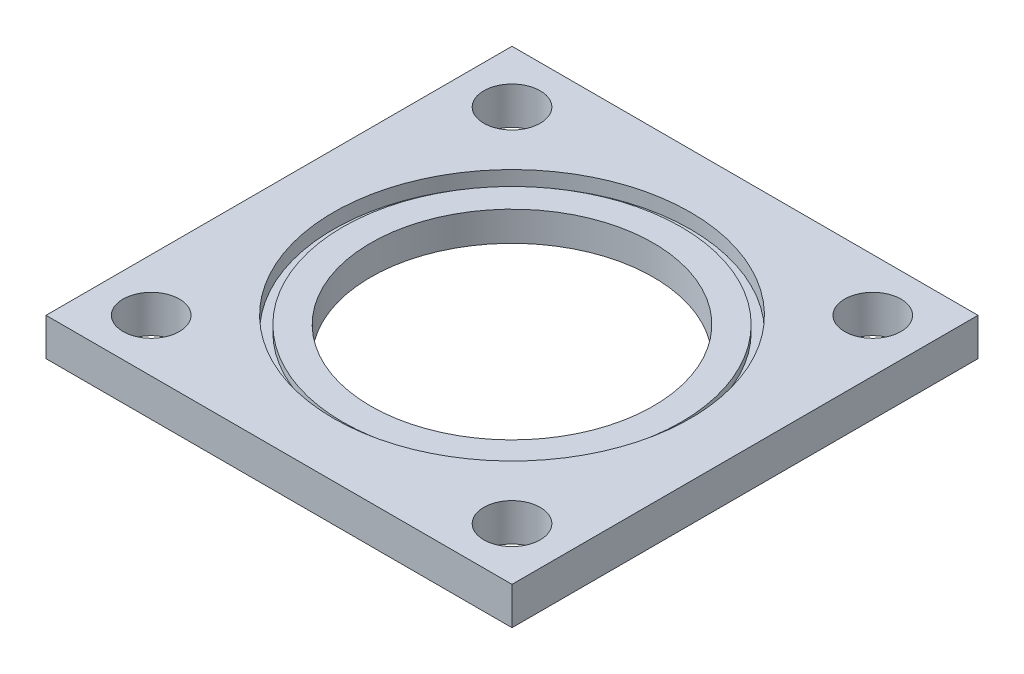
ISO-10303-21;
HEADER;
FILE_DESCRIPTION(('STEP AP214'),'2;1');
FILE_NAME('part.step','',(''),(''),'','','');
FILE_SCHEMA(('AUTOMOTIVE_DESIGN { 1 0 10303 214 1 1 1 1 }'));
ENDSEC;
DATA;
#1=APPLICATION_CONTEXT('core data for automotive mechanical design processes');
#2=APPLICATION_PROTOCOL_DEFINITION('international standard','automotive_design',2000,#1);
#3=PRODUCT_CONTEXT('',#1,'mechanical');
#4=PRODUCT('Part','Part','',(#3));
#5=PRODUCT_RELATED_PRODUCT_CATEGORY('part','',(#4));
#6=PRODUCT_DEFINITION_FORMATION('','',#4);
#7=PRODUCT_DEFINITION_CONTEXT('part definition',#1,'design');
#8=PRODUCT_DEFINITION('design','',#6,#7);
#9=PRODUCT_DEFINITION_SHAPE('','',#8);
#10=(LENGTH_UNIT() NAMED_UNIT(*) SI_UNIT(.MILLI.,.METRE.));
#11=(NAMED_UNIT(*) PLANE_ANGLE_UNIT() SI_UNIT($,.RADIAN.));
#12=(NAMED_UNIT(*) SI_UNIT($,.STERADIAN.) SOLID_ANGLE_UNIT());
#13=UNCERTAINTY_MEASURE_WITH_UNIT(LENGTH_MEASURE(1.E-05),#10,'distance_accuracy_value','');
#14=(GEOMETRIC_REPRESENTATION_CONTEXT(3) GLOBAL_UNCERTAINTY_ASSIGNED_CONTEXT((#13)) GLOBAL_UNIT_ASSIGNED_CONTEXT((#10,
#11,#12)) REPRESENTATION_CONTEXT('',''));
#15=CARTESIAN_POINT('',(0.,0.,0.));
#16=DIRECTION('',(0.,0.,1.));
#17=DIRECTION('',(1.,0.,0.));
#18=AXIS2_PLACEMENT_3D('',#15,#16,#17);
#19=CARTESIAN_POINT('',(0.,5.,0.));
#20=DIRECTION('',(0.,1.,0.));
#21=DIRECTION('',(0.,0.,1.));
#22=AXIS2_PLACEMENT_3D('',#19,#20,#21);
#23=PLANE('',#22);
#24=CARTESIAN_POINT('',(0.,5.,0.));
#25=DIRECTION('',(0.,1.,0.));
#26=DIRECTION('',(0.,0.,1.));
#27=AXIS2_PLACEMENT_3D('',#24,#25,#26);
#28=CIRCLE('',#27,23.876);
#29=CARTESIAN_POINT('',(0.,5.,23.876));
#30=VERTEX_POINT('',#29);
#31=EDGE_CURVE('E154',#30,#30,#28,.T.);
#32=ORIENTED_EDGE('',*,*,#31,.F.);
#33=EDGE_LOOP('',(#32));
#34=FACE_BOUND('',#33,.T.);
#35=CARTESIAN_POINT('',(0.,5.,0.));
#36=DIRECTION('',(0.,1.,0.));
#37=DIRECTION('',(0.,0.,1.));
#38=AXIS2_PLACEMENT_3D('',#35,#36,#37);
#39=CIRCLE('',#38,28.575);
#40=CARTESIAN_POINT('',(0.,5.,28.575));
#41=VERTEX_POINT('',#40);
#42=EDGE_CURVE('E203',#41,#41,#39,.T.);
#43=ORIENTED_EDGE('',*,*,#42,.T.);
#44=EDGE_LOOP('',(#43));
#45=FACE_BOUND('',#44,.T.);
#46=ADVANCED_FACE('F39',(#34,#45),#23,.T.);
#47=CARTESIAN_POINT('',(0.,0.,0.));
#48=DIRECTION('',(0.,-1.,0.));
#49=DIRECTION('',(0.,0.,-1.));
#50=AXIS2_PLACEMENT_3D('',#47,#48,#49);
#51=PLANE('',#50);
#52=CARTESIAN_POINT('',(30.48,0.,30.48));
#53=DIRECTION('',(0.,1.,0.));
#54=DIRECTION('',(0.,0.,1.));
#55=AXIS2_PLACEMENT_3D('',#52,#53,#54);
#56=CIRCLE('',#55,4.7625);
#57=CARTESIAN_POINT('',(30.48,0.,35.2425));
#58=VERTEX_POINT('',#57);
#59=EDGE_CURVE('E165',#58,#58,#56,.T.);
#60=ORIENTED_EDGE('',*,*,#59,.T.);
#61=EDGE_LOOP('',(#60));
#62=FACE_BOUND('',#61,.T.);
#63=CARTESIAN_POINT('',(-30.48,0.,30.48));
#64=DIRECTION('',(0.,1.,0.));
#65=DIRECTION('',(0.,0.,1.));
#66=AXIS2_PLACEMENT_3D('',#63,#64,#65);
#67=CIRCLE('',#66,4.7625);
#68=CARTESIAN_POINT('',(-30.48,0.,35.2425));
#69=VERTEX_POINT('',#68);
#70=EDGE_CURVE('E178',#69,#69,#67,.T.);
#71=ORIENTED_EDGE('',*,*,#70,.T.);
#72=EDGE_LOOP('',(#71));
#73=FACE_BOUND('',#72,.T.);
#74=DIRECTION('',(0.,0.,-1.));
#75=VECTOR('',#74,1.);
#76=CARTESIAN_POINT('',(-39.37,0.,39.37));
#77=LINE('',#76,#75);
#78=CARTESIAN_POINT('',(-39.37,0.,39.37));
#79=VERTEX_POINT('',#78);
#80=CARTESIAN_POINT('',(-39.37,0.,-39.37));
#81=VERTEX_POINT('',#80);
#82=EDGE_CURVE('E123',#79,#81,#77,.T.);
#83=ORIENTED_EDGE('',*,*,#82,.T.);
#84=DIRECTION('',(1.,0.,0.));
#85=VECTOR('',#84,1.);
#86=CARTESIAN_POINT('',(-39.37,0.,-39.37));
#87=LINE('',#86,#85);
#88=CARTESIAN_POINT('',(39.37,0.,-39.37));
#89=VERTEX_POINT('',#88);
#90=EDGE_CURVE('E127',#81,#89,#87,.T.);
#91=ORIENTED_EDGE('',*,*,#90,.T.);
#92=DIRECTION('',(0.,0.,-1.));
#93=VECTOR('',#92,1.);
#94=CARTESIAN_POINT('',(39.37,0.,39.37));
#95=LINE('',#94,#93);
#96=CARTESIAN_POINT('',(39.37,0.,39.37));
#97=VERTEX_POINT('',#96);
#98=EDGE_CURVE('E107',#97,#89,#95,.T.);
#99=ORIENTED_EDGE('',*,*,#98,.F.);
#100=DIRECTION('',(1.,0.,0.));
#101=VECTOR('',#100,1.);
#102=CARTESIAN_POINT('',(-39.37,0.,39.37));
#103=LINE('',#102,#101);
#104=EDGE_CURVE('E79',#79,#97,#103,.T.);
#105=ORIENTED_EDGE('',*,*,#104,.F.);
#106=EDGE_LOOP('',(#83,#91,#99,#105));
#107=FACE_BOUND('',#106,.T.);
#108=CARTESIAN_POINT('',(-30.48,0.,-30.48));
#109=DIRECTION('',(0.,1.,0.));
#110=DIRECTION('',(0.,0.,1.));
#111=AXIS2_PLACEMENT_3D('',#108,#109,#110);
#112=CIRCLE('',#111,4.7625);
#113=CARTESIAN_POINT('',(-30.48,0.,-25.7175));
#114=VERTEX_POINT('',#113);
#115=EDGE_CURVE('E144',#114,#114,#112,.T.);
#116=ORIENTED_EDGE('',*,*,#115,.T.);
#117=EDGE_LOOP('',(#116));
#118=FACE_BOUND('',#117,.T.);
#119=CARTESIAN_POINT('',(30.48,0.,-30.48));
#120=DIRECTION('',(0.,1.,0.));
#121=DIRECTION('',(0.,0.,1.));
#122=AXIS2_PLACEMENT_3D('',#119,#120,#121);
#123=CIRCLE('',#122,4.7625);
#124=CARTESIAN_POINT('',(30.48,0.,-25.7175));
#125=VERTEX_POINT('',#124);
#126=EDGE_CURVE('E148',#125,#125,#123,.T.);
#127=ORIENTED_EDGE('',*,*,#126,.T.);
#128=EDGE_LOOP('',(#127));
#129=FACE_BOUND('',#128,.T.);
#130=CARTESIAN_POINT('',(0.,0.,0.));
#131=DIRECTION('',(0.,1.,0.));
#132=DIRECTION('',(0.,0.,1.));
#133=AXIS2_PLACEMENT_3D('',#130,#131,#132);
#134=CIRCLE('',#133,23.876);
#135=CARTESIAN_POINT('',(0.,0.,23.876));
#136=VERTEX_POINT('',#135);
#137=EDGE_CURVE('E151',#136,#136,#134,.T.);
#138=ORIENTED_EDGE('',*,*,#137,.T.);
#139=EDGE_LOOP('',(#138));
#140=FACE_BOUND('',#139,.T.);
#141=ADVANCED_FACE('F136',(#62,#73,#107,#118,#129,#140),#51,.T.);
#142=CARTESIAN_POINT('',(0.,6.35,0.));
#143=DIRECTION('',(0.,-1.,0.));
#144=DIRECTION('',(0.,0.,-1.));
#145=AXIS2_PLACEMENT_3D('',#142,#143,#144);
#146=PLANE('',#145);
#147=CARTESIAN_POINT('',(30.48,6.35,30.48));
#148=DIRECTION('',(0.,-1.,0.));
#149=DIRECTION('',(0.,0.,-1.));
#150=AXIS2_PLACEMENT_3D('',#147,#148,#149);
#151=CIRCLE('',#150,4.7625);
#152=CARTESIAN_POINT('',(30.48,6.35,25.7175));
#153=VERTEX_POINT('',#152);
#154=EDGE_CURVE('E169',#153,#153,#151,.F.);
#155=ORIENTED_EDGE('',*,*,#154,.F.);
#156=EDGE_LOOP('',(#155));
#157=FACE_BOUND('',#156,.T.);
#158=CARTESIAN_POINT('',(-30.48,6.35,30.48));
#159=DIRECTION('',(0.,-1.,0.));
#160=DIRECTION('',(0.,0.,-1.));
#161=AXIS2_PLACEMENT_3D('',#158,#159,#160);
#162=CIRCLE('',#161,4.7625);
#163=CARTESIAN_POINT('',(-30.48,6.35,25.7175));
#164=VERTEX_POINT('',#163);
#165=EDGE_CURVE('E182',#164,#164,#162,.F.);
#166=ORIENTED_EDGE('',*,*,#165,.F.);
#167=EDGE_LOOP('',(#166));
#168=FACE_BOUND('',#167,.T.);
#169=DIRECTION('',(0.,0.,-1.));
#170=VECTOR('',#169,1.);
#171=CARTESIAN_POINT('',(-39.37,6.35,39.37));
#172=LINE('',#171,#170);
#173=CARTESIAN_POINT('',(-39.37,6.35,39.37));
#174=VERTEX_POINT('',#173);
#175=CARTESIAN_POINT('',(-39.37,6.35,-39.37));
#176=VERTEX_POINT('',#175);
#177=EDGE_CURVE('E113',#174,#176,#172,.T.);
#178=ORIENTED_EDGE('',*,*,#177,.F.);
#179=DIRECTION('',(1.,0.,0.));
#180=VECTOR('',#179,1.);
#181=CARTESIAN_POINT('',(-39.37,6.35,39.37));
#182=LINE('',#181,#180);
#183=CARTESIAN_POINT('',(39.37,6.35,39.37));
#184=VERTEX_POINT('',#183);
#185=EDGE_CURVE('E99',#174,#184,#182,.T.);
#186=ORIENTED_EDGE('',*,*,#185,.T.);
#187=DIRECTION('',(0.,0.,-1.));
#188=VECTOR('',#187,1.);
#189=CARTESIAN_POINT('',(39.37,6.35,39.37));
#190=LINE('',#189,#188);
#191=CARTESIAN_POINT('',(39.37,6.35,-39.37));
#192=VERTEX_POINT('',#191);
#193=EDGE_CURVE('E93',#184,#192,#190,.T.);
#194=ORIENTED_EDGE('',*,*,#193,.T.);
#195=DIRECTION('',(1.,0.,0.));
#196=VECTOR('',#195,1.);
#197=CARTESIAN_POINT('',(-39.37,6.35,-39.37));
#198=LINE('',#197,#196);
#199=EDGE_CURVE('E98',#176,#192,#198,.T.);
#200=ORIENTED_EDGE('',*,*,#199,.F.);
#201=EDGE_LOOP('',(#178,#186,#194,#200));
#202=FACE_BOUND('',#201,.T.);
#203=CARTESIAN_POINT('',(-30.48,6.35,-30.48));
#204=DIRECTION('',(0.,-1.,0.));
#205=DIRECTION('',(0.,0.,-1.));
#206=AXIS2_PLACEMENT_3D('',#203,#204,#205);
#207=CIRCLE('',#206,4.7625);
#208=CARTESIAN_POINT('',(-30.48,6.35,-35.2425));
#209=VERTEX_POINT('',#208);
#210=EDGE_CURVE('E128',#209,#209,#207,.F.);
#211=ORIENTED_EDGE('',*,*,#210,.F.);
#212=EDGE_LOOP('',(#211));
#213=FACE_BOUND('',#212,.T.);
#214=CARTESIAN_POINT('',(30.48,6.35,-30.48));
#215=DIRECTION('',(0.,-1.,0.));
#216=DIRECTION('',(0.,0.,-1.));
#217=AXIS2_PLACEMENT_3D('',#214,#215,#216);
#218=CIRCLE('',#217,4.7625);
#219=CARTESIAN_POINT('',(30.48,6.35,-35.2425));
#220=VERTEX_POINT('',#219);
#221=EDGE_CURVE('E175',#220,#220,#218,.F.);
#222=ORIENTED_EDGE('',*,*,#221,.F.);
#223=EDGE_LOOP('',(#222));
#224=FACE_BOUND('',#223,.T.);
#225=CARTESIAN_POINT('',(0.,6.35,0.));
#226=DIRECTION('',(0.,-1.,0.));
#227=DIRECTION('',(0.,0.,-1.));
#228=AXIS2_PLACEMENT_3D('',#225,#226,#227);
#229=CIRCLE('',#228,30.1625);
#230=CARTESIAN_POINT('',(0.,6.35,-30.1625));
#231=VERTEX_POINT('',#230);
#232=EDGE_CURVE('E43',#231,#231,#229,.F.);
#233=ORIENTED_EDGE('',*,*,#232,.F.);
#234=EDGE_LOOP('',(#233));
#235=FACE_BOUND('',#234,.T.);
#236=ADVANCED_FACE('F96',(#157,#168,#202,#213,#224,#235),#146,.F.);
#237=CARTESIAN_POINT('',(-39.37,6.35,39.37));
#238=DIRECTION('',(-1.,0.,0.));
#239=DIRECTION('',(0.,0.,1.));
#240=AXIS2_PLACEMENT_3D('',#237,#238,#239);
#241=PLANE('',#240);
#242=ORIENTED_EDGE('',*,*,#82,.F.);
#243=DIRECTION('',(0.,-1.,0.));
#244=VECTOR('',#243,1.);
#245=CARTESIAN_POINT('',(-39.37,6.35,39.37));
#246=LINE('',#245,#244);
#247=EDGE_CURVE('E11',#174,#79,#246,.T.);
#248=ORIENTED_EDGE('',*,*,#247,.F.);
#249=ORIENTED_EDGE('',*,*,#177,.T.);
#250=DIRECTION('',(0.,-1.,0.));
#251=VECTOR('',#250,1.);
#252=CARTESIAN_POINT('',(-39.37,6.35,-39.37));
#253=LINE('',#252,#251);
#254=EDGE_CURVE('E88',#176,#81,#253,.T.);
#255=ORIENTED_EDGE('',*,*,#254,.T.);
#256=EDGE_LOOP('',(#242,#248,#249,#255));
#257=FACE_BOUND('',#256,.T.);
#258=ADVANCED_FACE('F41',(#257),#241,.T.);
#259=CARTESIAN_POINT('',(-39.37,6.35,39.37));
#260=DIRECTION('',(0.,0.,-1.));
#261=DIRECTION('',(-1.,0.,0.));
#262=AXIS2_PLACEMENT_3D('',#259,#260,#261);
#263=PLANE('',#262);
#264=ORIENTED_EDGE('',*,*,#104,.T.);
#265=DIRECTION('',(0.,-1.,0.));
#266=VECTOR('',#265,1.);
#267=CARTESIAN_POINT('',(39.37,6.35,39.37));
#268=LINE('',#267,#266);
#269=EDGE_CURVE('E50',#184,#97,#268,.T.);
#270=ORIENTED_EDGE('',*,*,#269,.F.);
#271=ORIENTED_EDGE('',*,*,#185,.F.);
#272=ORIENTED_EDGE('',*,*,#247,.T.);
#273=EDGE_LOOP('',(#264,#270,#271,#272));
#274=FACE_BOUND('',#273,.T.);
#275=ADVANCED_FACE('F282',(#274),#263,.F.);
#276=CARTESIAN_POINT('',(39.37,6.35,39.37));
#277=DIRECTION('',(-1.,0.,0.));
#278=DIRECTION('',(0.,0.,1.));
#279=AXIS2_PLACEMENT_3D('',#276,#277,#278);
#280=PLANE('',#279);
#281=ORIENTED_EDGE('',*,*,#98,.T.);
#282=DIRECTION('',(0.,-1.,0.));
#283=VECTOR('',#282,1.);
#284=CARTESIAN_POINT('',(39.37,6.35,-39.37));
#285=LINE('',#284,#283);
#286=EDGE_CURVE('E104',#192,#89,#285,.T.);
#287=ORIENTED_EDGE('',*,*,#286,.F.);
#288=ORIENTED_EDGE('',*,*,#193,.F.);
#289=ORIENTED_EDGE('',*,*,#269,.T.);
#290=EDGE_LOOP('',(#281,#287,#288,#289));
#291=FACE_BOUND('',#290,.T.);
#292=ADVANCED_FACE('F105',(#291),#280,.F.);
#293=CARTESIAN_POINT('',(-39.37,6.35,-39.37));
#294=DIRECTION('',(0.,0.,-1.));
#295=DIRECTION('',(-1.,0.,0.));
#296=AXIS2_PLACEMENT_3D('',#293,#294,#295);
#297=PLANE('',#296);
#298=ORIENTED_EDGE('',*,*,#90,.F.);
#299=ORIENTED_EDGE('',*,*,#254,.F.);
#300=ORIENTED_EDGE('',*,*,#199,.T.);
#301=ORIENTED_EDGE('',*,*,#286,.T.);
#302=EDGE_LOOP('',(#298,#299,#300,#301));
#303=FACE_BOUND('',#302,.T.);
#304=ADVANCED_FACE('F111',(#303),#297,.T.);
#305=CARTESIAN_POINT('',(-30.48,10.,-30.48));
#306=DIRECTION('',(0.,-1.,0.));
#307=DIRECTION('',(0.,0.,-1.));
#308=AXIS2_PLACEMENT_3D('',#305,#306,#307);
#309=CYLINDRICAL_SURFACE('',#308,4.7625);
#310=ORIENTED_EDGE('',*,*,#115,.F.);
#311=EDGE_LOOP('',(#310));
#312=FACE_BOUND('',#311,.T.);
#313=ORIENTED_EDGE('',*,*,#210,.T.);
#314=EDGE_LOOP('',(#313));
#315=FACE_BOUND('',#314,.T.);
#316=ADVANCED_FACE('F191',(#312,#315),#309,.F.);
#317=CARTESIAN_POINT('',(-30.48,10.,30.48));
#318=DIRECTION('',(0.,-1.,0.));
#319=DIRECTION('',(0.,0.,-1.));
#320=AXIS2_PLACEMENT_3D('',#317,#318,#319);
#321=CYLINDRICAL_SURFACE('',#320,4.7625);
#322=ORIENTED_EDGE('',*,*,#70,.F.);
#323=EDGE_LOOP('',(#322));
#324=FACE_BOUND('',#323,.T.);
#325=ORIENTED_EDGE('',*,*,#165,.T.);
#326=EDGE_LOOP('',(#325));
#327=FACE_BOUND('',#326,.T.);
#328=ADVANCED_FACE('F305',(#324,#327),#321,.F.);
#329=CARTESIAN_POINT('',(30.48,10.,-30.48));
#330=DIRECTION('',(0.,-1.,0.));
#331=DIRECTION('',(0.,0.,-1.));
#332=AXIS2_PLACEMENT_3D('',#329,#330,#331);
#333=CYLINDRICAL_SURFACE('',#332,4.7625);
#334=ORIENTED_EDGE('',*,*,#126,.F.);
#335=EDGE_LOOP('',(#334));
#336=FACE_BOUND('',#335,.T.);
#337=ORIENTED_EDGE('',*,*,#221,.T.);
#338=EDGE_LOOP('',(#337));
#339=FACE_BOUND('',#338,.T.);
#340=ADVANCED_FACE('F231',(#336,#339),#333,.F.);
#341=CARTESIAN_POINT('',(30.48,10.,30.48));
#342=DIRECTION('',(0.,-1.,0.));
#343=DIRECTION('',(0.,0.,-1.));
#344=AXIS2_PLACEMENT_3D('',#341,#342,#343);
#345=CYLINDRICAL_SURFACE('',#344,4.7625);
#346=ORIENTED_EDGE('',*,*,#59,.F.);
#347=EDGE_LOOP('',(#346));
#348=FACE_BOUND('',#347,.T.);
#349=ORIENTED_EDGE('',*,*,#154,.T.);
#350=EDGE_LOOP('',(#349));
#351=FACE_BOUND('',#350,.T.);
#352=ADVANCED_FACE('F223',(#348,#351),#345,.F.);
#353=CARTESIAN_POINT('',(0.,10.,0.));
#354=DIRECTION('',(0.,-1.,0.));
#355=DIRECTION('',(0.,0.,-1.));
#356=AXIS2_PLACEMENT_3D('',#353,#354,#355);
#357=CYLINDRICAL_SURFACE('',#356,30.1625);
#358=ORIENTED_EDGE('',*,*,#232,.T.);
#359=EDGE_LOOP('',(#358));
#360=FACE_BOUND('',#359,.T.);
#361=CARTESIAN_POINT('',(0.,3.857,0.));
#362=DIRECTION('',(0.,1.,0.));
#363=DIRECTION('',(0.,0.,1.));
#364=AXIS2_PLACEMENT_3D('',#361,#362,#363);
#365=CIRCLE('',#364,30.1625);
#366=CARTESIAN_POINT('',(0.,3.857,30.1625));
#367=VERTEX_POINT('',#366);
#368=EDGE_CURVE('E155',#367,#367,#365,.T.);
#369=ORIENTED_EDGE('',*,*,#368,.F.);
#370=EDGE_LOOP('',(#369));
#371=FACE_BOUND('',#370,.T.);
#372=ADVANCED_FACE('F221',(#360,#371),#357,.F.);
#373=CARTESIAN_POINT('',(0.,5.,0.));
#374=DIRECTION('',(0.,-1.,0.));
#375=DIRECTION('',(0.,0.,-1.));
#376=AXIS2_PLACEMENT_3D('',#373,#374,#375);
#377=CYLINDRICAL_SURFACE('',#376,23.876);
#378=ORIENTED_EDGE('',*,*,#31,.T.);
#379=EDGE_LOOP('',(#378));
#380=FACE_BOUND('',#379,.T.);
#381=ORIENTED_EDGE('',*,*,#137,.F.);
#382=EDGE_LOOP('',(#381));
#383=FACE_BOUND('',#382,.T.);
#384=ADVANCED_FACE('F217',(#380,#383),#377,.F.);
#385=CARTESIAN_POINT('',(0.,3.857,0.));
#386=DIRECTION('',(0.,1.,0.));
#387=DIRECTION('',(0.,0.,1.));
#388=AXIS2_PLACEMENT_3D('',#385,#386,#387);
#389=PLANE('',#388);
#390=CARTESIAN_POINT('',(0.,3.857,0.));
#391=DIRECTION('',(0.,1.,0.));
#392=DIRECTION('',(0.,0.,1.));
#393=AXIS2_PLACEMENT_3D('',#390,#391,#392);
#394=CIRCLE('',#393,28.575);
#395=CARTESIAN_POINT('',(0.,3.857,28.575));
#396=VERTEX_POINT('',#395);
#397=EDGE_CURVE('E162',#396,#396,#394,.T.);
#398=ORIENTED_EDGE('',*,*,#397,.F.);
#399=EDGE_LOOP('',(#398));
#400=FACE_BOUND('',#399,.T.);
#401=ORIENTED_EDGE('',*,*,#368,.T.);
#402=EDGE_LOOP('',(#401));
#403=FACE_BOUND('',#402,.T.);
#404=ADVANCED_FACE('F214',(#400,#403),#389,.T.);
#405=CARTESIAN_POINT('',(0.,3.857,0.));
#406=DIRECTION('',(0.,1.,0.));
#407=DIRECTION('',(0.,0.,1.));
#408=AXIS2_PLACEMENT_3D('',#405,#406,#407);
#409=CYLINDRICAL_SURFACE('',#408,28.575);
#410=ORIENTED_EDGE('',*,*,#397,.T.);
#411=EDGE_LOOP('',(#410));
#412=FACE_BOUND('',#411,.T.);
#413=ORIENTED_EDGE('',*,*,#42,.F.);
#414=EDGE_LOOP('',(#413));
#415=FACE_BOUND('',#414,.T.);
#416=ADVANCED_FACE('F211',(#412,#415),#409,.T.);
#417=CLOSED_SHELL('',(#46,#141,#236,#258,#275,#292,#304,#316,#328,#340,#352,#372,#384,#404,#416));
#418=MANIFOLD_SOLID_BREP('B2',#417);
#419=ADVANCED_BREP_SHAPE_REPRESENTATION('',(#18,#418),#14);
#420=SHAPE_DEFINITION_REPRESENTATION(#9,#419);
ENDSEC;
END-ISO-10303-21;
